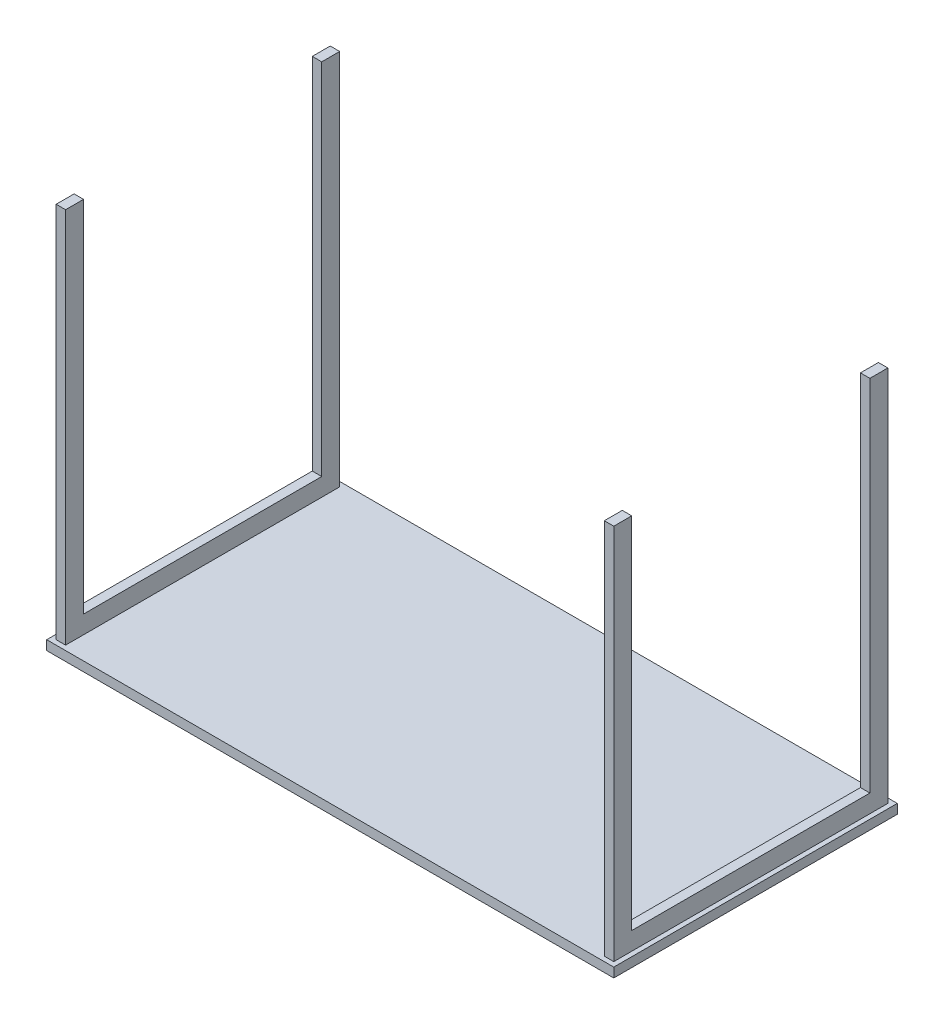
ISO-10303-21;
HEADER;
FILE_DESCRIPTION(('STEP AP214'),'2;1');
FILE_NAME('part.step','',(''),(''),'','','');
FILE_SCHEMA(('AUTOMOTIVE_DESIGN { 1 0 10303 214 1 1 1 1 }'));
ENDSEC;
DATA;
#1=APPLICATION_CONTEXT('core data for automotive mechanical design processes');
#2=APPLICATION_PROTOCOL_DEFINITION('international standard','automotive_design',2000,#1);
#3=PRODUCT_CONTEXT('',#1,'mechanical');
#4=PRODUCT('Part','Part','',(#3));
#5=PRODUCT_RELATED_PRODUCT_CATEGORY('part','',(#4));
#6=PRODUCT_DEFINITION_FORMATION('','',#4);
#7=PRODUCT_DEFINITION_CONTEXT('part definition',#1,'design');
#8=PRODUCT_DEFINITION('design','',#6,#7);
#9=PRODUCT_DEFINITION_SHAPE('','',#8);
#10=(LENGTH_UNIT() NAMED_UNIT(*) SI_UNIT(.MILLI.,.METRE.));
#11=(NAMED_UNIT(*) PLANE_ANGLE_UNIT() SI_UNIT($,.RADIAN.));
#12=(NAMED_UNIT(*) SI_UNIT($,.STERADIAN.) SOLID_ANGLE_UNIT());
#13=UNCERTAINTY_MEASURE_WITH_UNIT(LENGTH_MEASURE(1.E-05),#10,'distance_accuracy_value','');
#14=(GEOMETRIC_REPRESENTATION_CONTEXT(3) GLOBAL_UNCERTAINTY_ASSIGNED_CONTEXT((#13)) GLOBAL_UNIT_ASSIGNED_CONTEXT((#10,
#11,#12)) REPRESENTATION_CONTEXT('',''));
#15=CARTESIAN_POINT('',(0.,0.,0.));
#16=DIRECTION('',(0.,0.,1.));
#17=DIRECTION('',(1.,0.,0.));
#18=AXIS2_PLACEMENT_3D('',#15,#16,#17);
#19=CARTESIAN_POINT('',(1170.,58.,-590.));
#20=DIRECTION('',(0.,1.,0.));
#21=DIRECTION('',(0.,0.,1.));
#22=AXIS2_PLACEMENT_3D('',#19,#20,#21);
#23=PLANE('',#22);
#24=DIRECTION('',(0.,0.,-1.));
#25=VECTOR('',#24,1.);
#26=CARTESIAN_POINT('',(1190.,58.,-590.));
#27=LINE('',#26,#25);
#28=CARTESIAN_POINT('',(1190.,58.,-48.0000000000003));
#29=VERTEX_POINT('',#28);
#30=CARTESIAN_POINT('',(1190.,58.,-552.));
#31=VERTEX_POINT('',#30);
#32=EDGE_CURVE('E54',#29,#31,#27,.T.);
#33=ORIENTED_EDGE('',*,*,#32,.T.);
#34=DIRECTION('',(1.,0.,0.));
#35=VECTOR('',#34,1.);
#36=CARTESIAN_POINT('',(1190.,58.,-552.));
#37=LINE('',#36,#35);
#38=CARTESIAN_POINT('',(1170.,58.,-552.));
#39=VERTEX_POINT('',#38);
#40=EDGE_CURVE('E49',#39,#31,#37,.T.);
#41=ORIENTED_EDGE('',*,*,#40,.F.);
#42=DIRECTION('',(0.,0.,1.));
#43=VECTOR('',#42,1.);
#44=CARTESIAN_POINT('',(1170.,58.,-590.));
#45=LINE('',#44,#43);
#46=CARTESIAN_POINT('',(1170.,58.,-48.0000000000003));
#47=VERTEX_POINT('',#46);
#48=EDGE_CURVE('E35',#39,#47,#45,.T.);
#49=ORIENTED_EDGE('',*,*,#48,.T.);
#50=DIRECTION('',(-1.,0.,0.));
#51=VECTOR('',#50,1.);
#52=CARTESIAN_POINT('',(1190.,58.,-48.0000000000003));
#53=LINE('',#52,#51);
#54=EDGE_CURVE('E204',#29,#47,#53,.T.);
#55=ORIENTED_EDGE('',*,*,#54,.F.);
#56=EDGE_LOOP('',(#33,#41,#49,#55));
#57=FACE_BOUND('',#56,.T.);
#58=ADVANCED_FACE('F31',(#57),#23,.T.);
#59=CARTESIAN_POINT('',(30.,58.,-590.));
#60=DIRECTION('',(0.,-1.,0.));
#61=DIRECTION('',(0.,0.,-1.));
#62=AXIS2_PLACEMENT_3D('',#59,#60,#61);
#63=PLANE('',#62);
#64=DIRECTION('',(-1.,0.,0.));
#65=VECTOR('',#64,1.);
#66=CARTESIAN_POINT('',(10.0000000000001,58.,-48.));
#67=LINE('',#66,#65);
#68=CARTESIAN_POINT('',(30.0000000000001,58.,-48.));
#69=VERTEX_POINT('',#68);
#70=CARTESIAN_POINT('',(10.0000000000001,58.,-48.));
#71=VERTEX_POINT('',#70);
#72=EDGE_CURVE('E232',#69,#71,#67,.T.);
#73=ORIENTED_EDGE('',*,*,#72,.F.);
#74=DIRECTION('',(0.,0.,-1.));
#75=VECTOR('',#74,1.);
#76=CARTESIAN_POINT('',(30.,58.,-590.));
#77=LINE('',#76,#75);
#78=CARTESIAN_POINT('',(30.,58.,-552.));
#79=VERTEX_POINT('',#78);
#80=EDGE_CURVE('E282',#69,#79,#77,.T.);
#81=ORIENTED_EDGE('',*,*,#80,.T.);
#82=DIRECTION('',(1.,0.,0.));
#83=VECTOR('',#82,1.);
#84=CARTESIAN_POINT('',(10.,58.,-552.));
#85=LINE('',#84,#83);
#86=CARTESIAN_POINT('',(10.,58.,-552.));
#87=VERTEX_POINT('',#86);
#88=EDGE_CURVE('E254',#87,#79,#85,.T.);
#89=ORIENTED_EDGE('',*,*,#88,.F.);
#90=DIRECTION('',(0.,0.,1.));
#91=VECTOR('',#90,1.);
#92=CARTESIAN_POINT('',(10.,58.,-590.));
#93=LINE('',#92,#91);
#94=EDGE_CURVE('E272',#87,#71,#93,.T.);
#95=ORIENTED_EDGE('',*,*,#94,.T.);
#96=EDGE_LOOP('',(#73,#81,#89,#95));
#97=FACE_BOUND('',#96,.T.);
#98=ADVANCED_FACE('F360',(#97),#63,.F.);
#99=CARTESIAN_POINT('',(1200.,20.,0.));
#100=DIRECTION('',(0.,1.,0.));
#101=DIRECTION('',(0.,0.,1.));
#102=AXIS2_PLACEMENT_3D('',#99,#100,#101);
#103=PLANE('',#102);
#104=DIRECTION('',(0.,0.,1.));
#105=VECTOR('',#104,1.);
#106=CARTESIAN_POINT('',(10.,20.,-590.));
#107=LINE('',#106,#105);
#108=CARTESIAN_POINT('',(10.,20.,-590.));
#109=VERTEX_POINT('',#108);
#110=CARTESIAN_POINT('',(10.0000000000001,20.,-10.));
#111=VERTEX_POINT('',#110);
#112=EDGE_CURVE('E290',#109,#111,#107,.T.);
#113=ORIENTED_EDGE('',*,*,#112,.F.);
#114=DIRECTION('',(-1.,0.,0.));
#115=VECTOR('',#114,1.);
#116=CARTESIAN_POINT('',(10.,20.,-590.));
#117=LINE('',#116,#115);
#118=CARTESIAN_POINT('',(30.,20.,-590.));
#119=VERTEX_POINT('',#118);
#120=EDGE_CURVE('E179',#119,#109,#117,.T.);
#121=ORIENTED_EDGE('',*,*,#120,.F.);
#122=DIRECTION('',(0.,0.,-1.));
#123=VECTOR('',#122,1.);
#124=CARTESIAN_POINT('',(30.,20.,-590.));
#125=LINE('',#124,#123);
#126=CARTESIAN_POINT('',(30.,20.,-10.));
#127=VERTEX_POINT('',#126);
#128=EDGE_CURVE('E295',#127,#119,#125,.T.);
#129=ORIENTED_EDGE('',*,*,#128,.F.);
#130=DIRECTION('',(1.,0.,0.));
#131=VECTOR('',#130,1.);
#132=CARTESIAN_POINT('',(10.0000000000001,20.,-10.));
#133=LINE('',#132,#131);
#134=EDGE_CURVE('E292',#111,#127,#133,.T.);
#135=ORIENTED_EDGE('',*,*,#134,.F.);
#136=EDGE_LOOP('',(#113,#121,#129,#135));
#137=FACE_BOUND('',#136,.T.);
#138=DIRECTION('',(1.,0.,0.));
#139=VECTOR('',#138,1.);
#140=CARTESIAN_POINT('',(0.,20.,0.));
#141=LINE('',#140,#139);
#142=CARTESIAN_POINT('',(0.,20.,0.));
#143=VERTEX_POINT('',#142);
#144=CARTESIAN_POINT('',(1200.,20.,0.));
#145=VERTEX_POINT('',#144);
#146=EDGE_CURVE('E307',#143,#145,#141,.T.);
#147=ORIENTED_EDGE('',*,*,#146,.T.);
#148=DIRECTION('',(0.,0.,-1.));
#149=VECTOR('',#148,1.);
#150=CARTESIAN_POINT('',(1200.,20.,0.));
#151=LINE('',#150,#149);
#152=CARTESIAN_POINT('',(1200.,20.,-600.));
#153=VERTEX_POINT('',#152);
#154=EDGE_CURVE('E310',#145,#153,#151,.T.);
#155=ORIENTED_EDGE('',*,*,#154,.T.);
#156=DIRECTION('',(-1.,0.,0.));
#157=VECTOR('',#156,1.);
#158=CARTESIAN_POINT('',(0.,20.,-600.));
#159=LINE('',#158,#157);
#160=CARTESIAN_POINT('',(0.,20.,-600.));
#161=VERTEX_POINT('',#160);
#162=EDGE_CURVE('E313',#153,#161,#159,.T.);
#163=ORIENTED_EDGE('',*,*,#162,.T.);
#164=DIRECTION('',(0.,0.,1.));
#165=VECTOR('',#164,1.);
#166=CARTESIAN_POINT('',(0.,20.,0.));
#167=LINE('',#166,#165);
#168=EDGE_CURVE('E315',#161,#143,#167,.T.);
#169=ORIENTED_EDGE('',*,*,#168,.T.);
#170=EDGE_LOOP('',(#147,#155,#163,#169));
#171=FACE_BOUND('',#170,.T.);
#172=DIRECTION('',(0.,0.,1.));
#173=VECTOR('',#172,1.);
#174=CARTESIAN_POINT('',(1170.,20.,-590.));
#175=LINE('',#174,#173);
#176=CARTESIAN_POINT('',(1170.,20.,-590.));
#177=VERTEX_POINT('',#176);
#178=CARTESIAN_POINT('',(1170.,20.,-10.0000000000002));
#179=VERTEX_POINT('',#178);
#180=EDGE_CURVE('E622',#177,#179,#175,.T.);
#181=ORIENTED_EDGE('',*,*,#180,.F.);
#182=DIRECTION('',(-1.,0.,0.));
#183=VECTOR('',#182,1.);
#184=CARTESIAN_POINT('',(1190.,20.,-590.));
#185=LINE('',#184,#183);
#186=CARTESIAN_POINT('',(1190.,20.,-590.));
#187=VERTEX_POINT('',#186);
#188=EDGE_CURVE('E176',#187,#177,#185,.T.);
#189=ORIENTED_EDGE('',*,*,#188,.F.);
#190=DIRECTION('',(0.,0.,-1.));
#191=VECTOR('',#190,1.);
#192=CARTESIAN_POINT('',(1190.,20.,-590.));
#193=LINE('',#192,#191);
#194=CARTESIAN_POINT('',(1190.,20.,-10.0000000000002));
#195=VERTEX_POINT('',#194);
#196=EDGE_CURVE('E609',#195,#187,#193,.T.);
#197=ORIENTED_EDGE('',*,*,#196,.F.);
#198=DIRECTION('',(1.,0.,0.));
#199=VECTOR('',#198,1.);
#200=CARTESIAN_POINT('',(1190.,20.,-10.0000000000002));
#201=LINE('',#200,#199);
#202=EDGE_CURVE('E620',#179,#195,#201,.T.);
#203=ORIENTED_EDGE('',*,*,#202,.F.);
#204=EDGE_LOOP('',(#181,#189,#197,#203));
#205=FACE_BOUND('',#204,.T.);
#206=ADVANCED_FACE('F350',(#137,#171,#205),#103,.T.);
#207=CARTESIAN_POINT('',(0.,20.,0.));
#208=DIRECTION('',(0.,0.,-1.));
#209=DIRECTION('',(-1.,0.,0.));
#210=AXIS2_PLACEMENT_3D('',#207,#208,#209);
#211=PLANE('',#210);
#212=DIRECTION('',(1.,0.,0.));
#213=VECTOR('',#212,1.);
#214=CARTESIAN_POINT('',(0.,0.,0.));
#215=LINE('',#214,#213);
#216=CARTESIAN_POINT('',(0.,0.,0.));
#217=VERTEX_POINT('',#216);
#218=CARTESIAN_POINT('',(1200.,0.,0.));
#219=VERTEX_POINT('',#218);
#220=EDGE_CURVE('E306',#217,#219,#215,.T.);
#221=ORIENTED_EDGE('',*,*,#220,.T.);
#222=DIRECTION('',(0.,-1.,0.));
#223=VECTOR('',#222,1.);
#224=CARTESIAN_POINT('',(1200.,20.,0.));
#225=LINE('',#224,#223);
#226=EDGE_CURVE('E11',#145,#219,#225,.T.);
#227=ORIENTED_EDGE('',*,*,#226,.F.);
#228=ORIENTED_EDGE('',*,*,#146,.F.);
#229=DIRECTION('',(0.,-1.,0.));
#230=VECTOR('',#229,1.);
#231=CARTESIAN_POINT('',(0.,20.,0.));
#232=LINE('',#231,#230);
#233=EDGE_CURVE('E317',#143,#217,#232,.T.);
#234=ORIENTED_EDGE('',*,*,#233,.T.);
#235=EDGE_LOOP('',(#221,#227,#228,#234));
#236=FACE_BOUND('',#235,.T.);
#237=ADVANCED_FACE('F33',(#236),#211,.F.);
#238=CARTESIAN_POINT('',(1200.,20.,0.));
#239=DIRECTION('',(-1.,0.,0.));
#240=DIRECTION('',(0.,0.,1.));
#241=AXIS2_PLACEMENT_3D('',#238,#239,#240);
#242=PLANE('',#241);
#243=DIRECTION('',(0.,0.,-1.));
#244=VECTOR('',#243,1.);
#245=CARTESIAN_POINT('',(1200.,0.,0.));
#246=LINE('',#245,#244);
#247=CARTESIAN_POINT('',(1200.,0.,-600.));
#248=VERTEX_POINT('',#247);
#249=EDGE_CURVE('E320',#219,#248,#246,.T.);
#250=ORIENTED_EDGE('',*,*,#249,.T.);
#251=DIRECTION('',(0.,-1.,0.));
#252=VECTOR('',#251,1.);
#253=CARTESIAN_POINT('',(1200.,20.,-600.));
#254=LINE('',#253,#252);
#255=EDGE_CURVE('E41',#153,#248,#254,.T.);
#256=ORIENTED_EDGE('',*,*,#255,.F.);
#257=ORIENTED_EDGE('',*,*,#154,.F.);
#258=ORIENTED_EDGE('',*,*,#226,.T.);
#259=EDGE_LOOP('',(#250,#256,#257,#258));
#260=FACE_BOUND('',#259,.T.);
#261=ADVANCED_FACE('F352',(#260),#242,.F.);
#262=CARTESIAN_POINT('',(0.,20.,-600.));
#263=DIRECTION('',(0.,0.,1.));
#264=DIRECTION('',(1.,0.,0.));
#265=AXIS2_PLACEMENT_3D('',#262,#263,#264);
#266=PLANE('',#265);
#267=DIRECTION('',(-1.,0.,0.));
#268=VECTOR('',#267,1.);
#269=CARTESIAN_POINT('',(0.,0.,-600.));
#270=LINE('',#269,#268);
#271=CARTESIAN_POINT('',(0.,0.,-600.));
#272=VERTEX_POINT('',#271);
#273=EDGE_CURVE('E322',#248,#272,#270,.T.);
#274=ORIENTED_EDGE('',*,*,#273,.T.);
#275=DIRECTION('',(0.,-1.,0.));
#276=VECTOR('',#275,1.);
#277=CARTESIAN_POINT('',(0.,20.,-600.));
#278=LINE('',#277,#276);
#279=EDGE_CURVE('E327',#161,#272,#278,.T.);
#280=ORIENTED_EDGE('',*,*,#279,.F.);
#281=ORIENTED_EDGE('',*,*,#162,.F.);
#282=ORIENTED_EDGE('',*,*,#255,.T.);
#283=EDGE_LOOP('',(#274,#280,#281,#282));
#284=FACE_BOUND('',#283,.T.);
#285=ADVANCED_FACE('F335',(#284),#266,.F.);
#286=CARTESIAN_POINT('',(0.,20.,0.));
#287=DIRECTION('',(1.,0.,0.));
#288=DIRECTION('',(0.,0.,-1.));
#289=AXIS2_PLACEMENT_3D('',#286,#287,#288);
#290=PLANE('',#289);
#291=DIRECTION('',(0.,0.,1.));
#292=VECTOR('',#291,1.);
#293=CARTESIAN_POINT('',(0.,0.,0.));
#294=LINE('',#293,#292);
#295=EDGE_CURVE('E311',#272,#217,#294,.T.);
#296=ORIENTED_EDGE('',*,*,#295,.T.);
#297=ORIENTED_EDGE('',*,*,#233,.F.);
#298=ORIENTED_EDGE('',*,*,#168,.F.);
#299=ORIENTED_EDGE('',*,*,#279,.T.);
#300=EDGE_LOOP('',(#296,#297,#298,#299));
#301=FACE_BOUND('',#300,.T.);
#302=ADVANCED_FACE('F344',(#301),#290,.F.);
#303=CARTESIAN_POINT('',(1200.,0.,0.));
#304=DIRECTION('',(0.,1.,0.));
#305=DIRECTION('',(0.,0.,1.));
#306=AXIS2_PLACEMENT_3D('',#303,#304,#305);
#307=PLANE('',#306);
#308=ORIENTED_EDGE('',*,*,#220,.F.);
#309=ORIENTED_EDGE('',*,*,#295,.F.);
#310=ORIENTED_EDGE('',*,*,#273,.F.);
#311=ORIENTED_EDGE('',*,*,#249,.F.);
#312=EDGE_LOOP('',(#308,#309,#310,#311));
#313=FACE_BOUND('',#312,.T.);
#314=ADVANCED_FACE('F341',(#313),#307,.F.);
#315=CARTESIAN_POINT('',(10.,58.,-590.));
#316=DIRECTION('',(0.,0.,1.));
#317=DIRECTION('',(1.,0.,0.));
#318=AXIS2_PLACEMENT_3D('',#315,#316,#317);
#319=PLANE('',#318);
#320=ORIENTED_EDGE('',*,*,#120,.T.);
#321=DIRECTION('',(0.,-1.,0.));
#322=VECTOR('',#321,1.);
#323=CARTESIAN_POINT('',(10.,58.,-590.));
#324=LINE('',#323,#322);
#325=CARTESIAN_POINT('',(10.,818.,-590.));
#326=VERTEX_POINT('',#325);
#327=EDGE_CURVE('E304',#326,#109,#324,.T.);
#328=ORIENTED_EDGE('',*,*,#327,.F.);
#329=DIRECTION('',(-1.,0.,0.));
#330=VECTOR('',#329,1.);
#331=CARTESIAN_POINT('',(10.,818.,-590.));
#332=LINE('',#331,#330);
#333=CARTESIAN_POINT('',(30.,818.,-590.));
#334=VERTEX_POINT('',#333);
#335=EDGE_CURVE('E255',#334,#326,#332,.T.);
#336=ORIENTED_EDGE('',*,*,#335,.F.);
#337=DIRECTION('',(0.,-1.,0.));
#338=VECTOR('',#337,1.);
#339=CARTESIAN_POINT('',(30.,58.,-590.));
#340=LINE('',#339,#338);
#341=EDGE_CURVE('E284',#334,#119,#340,.T.);
#342=ORIENTED_EDGE('',*,*,#341,.T.);
#343=EDGE_LOOP('',(#320,#328,#336,#342));
#344=FACE_BOUND('',#343,.T.);
#345=ADVANCED_FACE('F394',(#344),#319,.F.);
#346=CARTESIAN_POINT('',(10.,58.,-590.));
#347=DIRECTION('',(1.,0.,0.));
#348=DIRECTION('',(0.,0.,-1.));
#349=AXIS2_PLACEMENT_3D('',#346,#347,#348);
#350=PLANE('',#349);
#351=ORIENTED_EDGE('',*,*,#112,.T.);
#352=DIRECTION('',(0.,-1.,0.));
#353=VECTOR('',#352,1.);
#354=CARTESIAN_POINT('',(10.0000000000001,58.,-10.));
#355=LINE('',#354,#353);
#356=CARTESIAN_POINT('',(10.0000000000001,818.,-10.));
#357=VERTEX_POINT('',#356);
#358=EDGE_CURVE('E301',#357,#111,#355,.T.);
#359=ORIENTED_EDGE('',*,*,#358,.F.);
#360=DIRECTION('',(0.,0.,1.));
#361=VECTOR('',#360,1.);
#362=CARTESIAN_POINT('',(10.0000000000001,818.,-10.));
#363=LINE('',#362,#361);
#364=CARTESIAN_POINT('',(10.0000000000001,818.,-48.));
#365=VERTEX_POINT('',#364);
#366=EDGE_CURVE('E248',#365,#357,#363,.T.);
#367=ORIENTED_EDGE('',*,*,#366,.F.);
#368=DIRECTION('',(0.,-1.,0.));
#369=VECTOR('',#368,1.);
#370=CARTESIAN_POINT('',(10.0000000000001,818.,-48.));
#371=LINE('',#370,#369);
#372=EDGE_CURVE('E250',#365,#71,#371,.T.);
#373=ORIENTED_EDGE('',*,*,#372,.T.);
#374=ORIENTED_EDGE('',*,*,#94,.F.);
#375=DIRECTION('',(0.,-1.,0.));
#376=VECTOR('',#375,1.);
#377=CARTESIAN_POINT('',(10.,818.,-552.));
#378=LINE('',#377,#376);
#379=CARTESIAN_POINT('',(10.,818.,-552.));
#380=VERTEX_POINT('',#379);
#381=EDGE_CURVE('E276',#380,#87,#378,.T.);
#382=ORIENTED_EDGE('',*,*,#381,.F.);
#383=DIRECTION('',(0.,0.,1.));
#384=VECTOR('',#383,1.);
#385=CARTESIAN_POINT('',(10.,818.,-590.));
#386=LINE('',#385,#384);
#387=EDGE_CURVE('E258',#326,#380,#386,.T.);
#388=ORIENTED_EDGE('',*,*,#387,.F.);
#389=ORIENTED_EDGE('',*,*,#327,.T.);
#390=EDGE_LOOP('',(#351,#359,#367,#373,#374,#382,#388,#389));
#391=FACE_BOUND('',#390,.T.);
#392=ADVANCED_FACE('F390',(#391),#350,.F.);
#393=CARTESIAN_POINT('',(10.0000000000001,58.,-10.));
#394=DIRECTION('',(0.,0.,-1.));
#395=DIRECTION('',(-1.,0.,0.));
#396=AXIS2_PLACEMENT_3D('',#393,#394,#395);
#397=PLANE('',#396);
#398=ORIENTED_EDGE('',*,*,#134,.T.);
#399=DIRECTION('',(0.,-1.,0.));
#400=VECTOR('',#399,1.);
#401=CARTESIAN_POINT('',(30.0000000000001,58.,-10.));
#402=LINE('',#401,#400);
#403=CARTESIAN_POINT('',(30.0000000000001,818.,-10.));
#404=VERTEX_POINT('',#403);
#405=EDGE_CURVE('E299',#404,#127,#402,.T.);
#406=ORIENTED_EDGE('',*,*,#405,.F.);
#407=DIRECTION('',(1.,0.,0.));
#408=VECTOR('',#407,1.);
#409=CARTESIAN_POINT('',(10.0000000000001,818.,-10.));
#410=LINE('',#409,#408);
#411=EDGE_CURVE('E218',#357,#404,#410,.T.);
#412=ORIENTED_EDGE('',*,*,#411,.F.);
#413=ORIENTED_EDGE('',*,*,#358,.T.);
#414=EDGE_LOOP('',(#398,#406,#412,#413));
#415=FACE_BOUND('',#414,.T.);
#416=ADVANCED_FACE('F386',(#415),#397,.F.);
#417=CARTESIAN_POINT('',(30.,58.,-590.));
#418=DIRECTION('',(-1.,0.,0.));
#419=DIRECTION('',(0.,0.,1.));
#420=AXIS2_PLACEMENT_3D('',#417,#418,#419);
#421=PLANE('',#420);
#422=ORIENTED_EDGE('',*,*,#128,.T.);
#423=ORIENTED_EDGE('',*,*,#341,.F.);
#424=DIRECTION('',(0.,0.,-1.));
#425=VECTOR('',#424,1.);
#426=CARTESIAN_POINT('',(30.,818.,-590.));
#427=LINE('',#426,#425);
#428=CARTESIAN_POINT('',(30.,818.,-552.));
#429=VERTEX_POINT('',#428);
#430=EDGE_CURVE('E262',#429,#334,#427,.T.);
#431=ORIENTED_EDGE('',*,*,#430,.F.);
#432=DIRECTION('',(0.,-1.,0.));
#433=VECTOR('',#432,1.);
#434=CARTESIAN_POINT('',(30.,818.,-552.));
#435=LINE('',#434,#433);
#436=EDGE_CURVE('E265',#429,#79,#435,.T.);
#437=ORIENTED_EDGE('',*,*,#436,.T.);
#438=ORIENTED_EDGE('',*,*,#80,.F.);
#439=DIRECTION('',(0.,-1.,0.));
#440=VECTOR('',#439,1.);
#441=CARTESIAN_POINT('',(30.0000000000001,818.,-48.));
#442=LINE('',#441,#440);
#443=CARTESIAN_POINT('',(30.0000000000001,818.,-48.));
#444=VERTEX_POINT('',#443);
#445=EDGE_CURVE('E252',#444,#69,#442,.T.);
#446=ORIENTED_EDGE('',*,*,#445,.F.);
#447=DIRECTION('',(0.,0.,-1.));
#448=VECTOR('',#447,1.);
#449=CARTESIAN_POINT('',(30.0000000000001,818.,-10.));
#450=LINE('',#449,#448);
#451=EDGE_CURVE('E245',#404,#444,#450,.T.);
#452=ORIENTED_EDGE('',*,*,#451,.F.);
#453=ORIENTED_EDGE('',*,*,#405,.T.);
#454=EDGE_LOOP('',(#422,#423,#431,#437,#438,#446,#452,#453));
#455=FACE_BOUND('',#454,.T.);
#456=ADVANCED_FACE('F382',(#455),#421,.F.);
#457=CARTESIAN_POINT('',(1190.,58.,-590.));
#458=DIRECTION('',(0.,0.,1.));
#459=DIRECTION('',(1.,0.,0.));
#460=AXIS2_PLACEMENT_3D('',#457,#458,#459);
#461=PLANE('',#460);
#462=ORIENTED_EDGE('',*,*,#188,.T.);
#463=DIRECTION('',(0.,-1.,0.));
#464=VECTOR('',#463,1.);
#465=CARTESIAN_POINT('',(1170.,58.,-590.));
#466=LINE('',#465,#464);
#467=CARTESIAN_POINT('',(1170.,818.,-590.));
#468=VERTEX_POINT('',#467);
#469=EDGE_CURVE('E169',#468,#177,#466,.T.);
#470=ORIENTED_EDGE('',*,*,#469,.F.);
#471=DIRECTION('',(-1.,0.,0.));
#472=VECTOR('',#471,1.);
#473=CARTESIAN_POINT('',(1190.,818.,-590.));
#474=LINE('',#473,#472);
#475=CARTESIAN_POINT('',(1190.,818.,-590.));
#476=VERTEX_POINT('',#475);
#477=EDGE_CURVE('E174',#476,#468,#474,.T.);
#478=ORIENTED_EDGE('',*,*,#477,.F.);
#479=DIRECTION('',(0.,-1.,0.));
#480=VECTOR('',#479,1.);
#481=CARTESIAN_POINT('',(1190.,58.,-590.));
#482=LINE('',#481,#480);
#483=EDGE_CURVE('E607',#476,#187,#482,.T.);
#484=ORIENTED_EDGE('',*,*,#483,.T.);
#485=EDGE_LOOP('',(#462,#470,#478,#484));
#486=FACE_BOUND('',#485,.T.);
#487=ADVANCED_FACE('F171',(#486),#461,.F.);
#488=CARTESIAN_POINT('',(1170.,58.,-590.));
#489=DIRECTION('',(1.,0.,0.));
#490=DIRECTION('',(0.,0.,-1.));
#491=AXIS2_PLACEMENT_3D('',#488,#489,#490);
#492=PLANE('',#491);
#493=ORIENTED_EDGE('',*,*,#180,.T.);
#494=DIRECTION('',(0.,-1.,0.));
#495=VECTOR('',#494,1.);
#496=CARTESIAN_POINT('',(1170.,58.,-10.0000000000002));
#497=LINE('',#496,#495);
#498=CARTESIAN_POINT('',(1170.,818.,-10.0000000000002));
#499=VERTEX_POINT('',#498);
#500=EDGE_CURVE('E180',#499,#179,#497,.T.);
#501=ORIENTED_EDGE('',*,*,#500,.F.);
#502=DIRECTION('',(0.,0.,1.));
#503=VECTOR('',#502,1.);
#504=CARTESIAN_POINT('',(1170.,818.,-10.0000000000002));
#505=LINE('',#504,#503);
#506=CARTESIAN_POINT('',(1170.,818.,-48.0000000000003));
#507=VERTEX_POINT('',#506);
#508=EDGE_CURVE('E212',#507,#499,#505,.T.);
#509=ORIENTED_EDGE('',*,*,#508,.F.);
#510=DIRECTION('',(0.,-1.,0.));
#511=VECTOR('',#510,1.);
#512=CARTESIAN_POINT('',(1170.,818.,-48.0000000000003));
#513=LINE('',#512,#511);
#514=EDGE_CURVE('E215',#507,#47,#513,.T.);
#515=ORIENTED_EDGE('',*,*,#514,.T.);
#516=ORIENTED_EDGE('',*,*,#48,.F.);
#517=DIRECTION('',(0.,-1.,0.));
#518=VECTOR('',#517,1.);
#519=CARTESIAN_POINT('',(1170.,818.,-552.));
#520=LINE('',#519,#518);
#521=CARTESIAN_POINT('',(1170.,818.,-552.));
#522=VERTEX_POINT('',#521);
#523=EDGE_CURVE('E186',#522,#39,#520,.T.);
#524=ORIENTED_EDGE('',*,*,#523,.F.);
#525=DIRECTION('',(0.,0.,1.));
#526=VECTOR('',#525,1.);
#527=CARTESIAN_POINT('',(1170.,818.,-590.));
#528=LINE('',#527,#526);
#529=EDGE_CURVE('E183',#468,#522,#528,.T.);
#530=ORIENTED_EDGE('',*,*,#529,.F.);
#531=ORIENTED_EDGE('',*,*,#469,.T.);
#532=EDGE_LOOP('',(#493,#501,#509,#515,#516,#524,#530,#531));
#533=FACE_BOUND('',#532,.T.);
#534=ADVANCED_FACE('F184',(#533),#492,.F.);
#535=CARTESIAN_POINT('',(1190.,58.,-10.0000000000002));
#536=DIRECTION('',(0.,0.,-1.));
#537=DIRECTION('',(-1.,0.,0.));
#538=AXIS2_PLACEMENT_3D('',#535,#536,#537);
#539=PLANE('',#538);
#540=ORIENTED_EDGE('',*,*,#202,.T.);
#541=DIRECTION('',(0.,-1.,0.));
#542=VECTOR('',#541,1.);
#543=CARTESIAN_POINT('',(1190.,58.,-10.0000000000002));
#544=LINE('',#543,#542);
#545=CARTESIAN_POINT('',(1190.,818.,-10.0000000000002));
#546=VERTEX_POINT('',#545);
#547=EDGE_CURVE('E610',#546,#195,#544,.T.);
#548=ORIENTED_EDGE('',*,*,#547,.F.);
#549=DIRECTION('',(1.,0.,0.));
#550=VECTOR('',#549,1.);
#551=CARTESIAN_POINT('',(1190.,818.,-10.0000000000002));
#552=LINE('',#551,#550);
#553=EDGE_CURVE('E205',#499,#546,#552,.T.);
#554=ORIENTED_EDGE('',*,*,#553,.F.);
#555=ORIENTED_EDGE('',*,*,#500,.T.);
#556=EDGE_LOOP('',(#540,#548,#554,#555));
#557=FACE_BOUND('',#556,.T.);
#558=ADVANCED_FACE('F374',(#557),#539,.F.);
#559=CARTESIAN_POINT('',(1190.,58.,-590.));
#560=DIRECTION('',(-1.,0.,0.));
#561=DIRECTION('',(0.,0.,1.));
#562=AXIS2_PLACEMENT_3D('',#559,#560,#561);
#563=PLANE('',#562);
#564=ORIENTED_EDGE('',*,*,#196,.T.);
#565=ORIENTED_EDGE('',*,*,#483,.F.);
#566=DIRECTION('',(0.,0.,-1.));
#567=VECTOR('',#566,1.);
#568=CARTESIAN_POINT('',(1190.,818.,-590.));
#569=LINE('',#568,#567);
#570=CARTESIAN_POINT('',(1190.,818.,-552.));
#571=VERTEX_POINT('',#570);
#572=EDGE_CURVE('E194',#571,#476,#569,.T.);
#573=ORIENTED_EDGE('',*,*,#572,.F.);
#574=DIRECTION('',(0.,-1.,0.));
#575=VECTOR('',#574,1.);
#576=CARTESIAN_POINT('',(1190.,818.,-552.));
#577=LINE('',#576,#575);
#578=EDGE_CURVE('E199',#571,#31,#577,.T.);
#579=ORIENTED_EDGE('',*,*,#578,.T.);
#580=ORIENTED_EDGE('',*,*,#32,.F.);
#581=DIRECTION('',(0.,-1.,0.));
#582=VECTOR('',#581,1.);
#583=CARTESIAN_POINT('',(1190.,818.,-48.0000000000003));
#584=LINE('',#583,#582);
#585=CARTESIAN_POINT('',(1190.,818.,-48.0000000000003));
#586=VERTEX_POINT('',#585);
#587=EDGE_CURVE('E228',#586,#29,#584,.T.);
#588=ORIENTED_EDGE('',*,*,#587,.F.);
#589=DIRECTION('',(0.,0.,-1.));
#590=VECTOR('',#589,1.);
#591=CARTESIAN_POINT('',(1190.,818.,-10.0000000000002));
#592=LINE('',#591,#590);
#593=EDGE_CURVE('E208',#546,#586,#592,.T.);
#594=ORIENTED_EDGE('',*,*,#593,.F.);
#595=ORIENTED_EDGE('',*,*,#547,.T.);
#596=EDGE_LOOP('',(#564,#565,#573,#579,#580,#588,#594,#595));
#597=FACE_BOUND('',#596,.T.);
#598=ADVANCED_FACE('F371',(#597),#563,.F.);
#599=CARTESIAN_POINT('',(10.,818.,-552.));
#600=DIRECTION('',(0.,0.,-1.));
#601=DIRECTION('',(-1.,0.,0.));
#602=AXIS2_PLACEMENT_3D('',#599,#600,#601);
#603=PLANE('',#602);
#604=ORIENTED_EDGE('',*,*,#88,.T.);
#605=ORIENTED_EDGE('',*,*,#436,.F.);
#606=DIRECTION('',(1.,0.,0.));
#607=VECTOR('',#606,1.);
#608=CARTESIAN_POINT('',(10.,818.,-552.));
#609=LINE('',#608,#607);
#610=EDGE_CURVE('E260',#380,#429,#609,.T.);
#611=ORIENTED_EDGE('',*,*,#610,.F.);
#612=ORIENTED_EDGE('',*,*,#381,.T.);
#613=EDGE_LOOP('',(#604,#605,#611,#612));
#614=FACE_BOUND('',#613,.T.);
#615=ADVANCED_FACE('F369',(#614),#603,.F.);
#616=CARTESIAN_POINT('',(30.,818.,-590.));
#617=DIRECTION('',(0.,-1.,0.));
#618=DIRECTION('',(0.,0.,-1.));
#619=AXIS2_PLACEMENT_3D('',#616,#617,#618);
#620=PLANE('',#619);
#621=ORIENTED_EDGE('',*,*,#335,.T.);
#622=ORIENTED_EDGE('',*,*,#387,.T.);
#623=ORIENTED_EDGE('',*,*,#610,.T.);
#624=ORIENTED_EDGE('',*,*,#430,.T.);
#625=EDGE_LOOP('',(#621,#622,#623,#624));
#626=FACE_BOUND('',#625,.T.);
#627=ADVANCED_FACE('F453',(#626),#620,.F.);
#628=CARTESIAN_POINT('',(10.0000000000001,818.,-48.));
#629=DIRECTION('',(0.,0.,1.));
#630=DIRECTION('',(1.,0.,0.));
#631=AXIS2_PLACEMENT_3D('',#628,#629,#630);
#632=PLANE('',#631);
#633=ORIENTED_EDGE('',*,*,#72,.T.);
#634=ORIENTED_EDGE('',*,*,#372,.F.);
#635=DIRECTION('',(-1.,0.,0.));
#636=VECTOR('',#635,1.);
#637=CARTESIAN_POINT('',(10.0000000000001,818.,-48.));
#638=LINE('',#637,#636);
#639=EDGE_CURVE('E636',#444,#365,#638,.T.);
#640=ORIENTED_EDGE('',*,*,#639,.F.);
#641=ORIENTED_EDGE('',*,*,#445,.T.);
#642=EDGE_LOOP('',(#633,#634,#640,#641));
#643=FACE_BOUND('',#642,.T.);
#644=ADVANCED_FACE('F460',(#643),#632,.F.);
#645=CARTESIAN_POINT('',(30.0000000000001,818.,-10.));
#646=DIRECTION('',(0.,1.,0.));
#647=DIRECTION('',(0.,0.,1.));
#648=AXIS2_PLACEMENT_3D('',#645,#646,#647);
#649=PLANE('',#648);
#650=ORIENTED_EDGE('',*,*,#411,.T.);
#651=ORIENTED_EDGE('',*,*,#451,.T.);
#652=ORIENTED_EDGE('',*,*,#639,.T.);
#653=ORIENTED_EDGE('',*,*,#366,.T.);
#654=EDGE_LOOP('',(#650,#651,#652,#653));
#655=FACE_BOUND('',#654,.T.);
#656=ADVANCED_FACE('F467',(#655),#649,.T.);
#657=CARTESIAN_POINT('',(1190.,818.,-48.0000000000003));
#658=DIRECTION('',(0.,0.,1.));
#659=DIRECTION('',(1.,0.,0.));
#660=AXIS2_PLACEMENT_3D('',#657,#658,#659);
#661=PLANE('',#660);
#662=ORIENTED_EDGE('',*,*,#54,.T.);
#663=ORIENTED_EDGE('',*,*,#514,.F.);
#664=DIRECTION('',(-1.,0.,0.));
#665=VECTOR('',#664,1.);
#666=CARTESIAN_POINT('',(1190.,818.,-48.0000000000003));
#667=LINE('',#666,#665);
#668=EDGE_CURVE('E210',#586,#507,#667,.T.);
#669=ORIENTED_EDGE('',*,*,#668,.F.);
#670=ORIENTED_EDGE('',*,*,#587,.T.);
#671=EDGE_LOOP('',(#662,#663,#669,#670));
#672=FACE_BOUND('',#671,.T.);
#673=ADVANCED_FACE('F474',(#672),#661,.F.);
#674=CARTESIAN_POINT('',(1170.,818.,-10.0000000000002));
#675=DIRECTION('',(0.,-1.,0.));
#676=DIRECTION('',(0.,0.,-1.));
#677=AXIS2_PLACEMENT_3D('',#674,#675,#676);
#678=PLANE('',#677);
#679=ORIENTED_EDGE('',*,*,#553,.T.);
#680=ORIENTED_EDGE('',*,*,#593,.T.);
#681=ORIENTED_EDGE('',*,*,#668,.T.);
#682=ORIENTED_EDGE('',*,*,#508,.T.);
#683=EDGE_LOOP('',(#679,#680,#681,#682));
#684=FACE_BOUND('',#683,.T.);
#685=ADVANCED_FACE('F482',(#684),#678,.F.);
#686=CARTESIAN_POINT('',(1190.,818.,-552.));
#687=DIRECTION('',(0.,0.,-1.));
#688=DIRECTION('',(-1.,0.,0.));
#689=AXIS2_PLACEMENT_3D('',#686,#687,#688);
#690=PLANE('',#689);
#691=ORIENTED_EDGE('',*,*,#40,.T.);
#692=ORIENTED_EDGE('',*,*,#578,.F.);
#693=DIRECTION('',(1.,0.,0.));
#694=VECTOR('',#693,1.);
#695=CARTESIAN_POINT('',(1190.,818.,-552.));
#696=LINE('',#695,#694);
#697=EDGE_CURVE('E189',#522,#571,#696,.T.);
#698=ORIENTED_EDGE('',*,*,#697,.F.);
#699=ORIENTED_EDGE('',*,*,#523,.T.);
#700=EDGE_LOOP('',(#691,#692,#698,#699));
#701=FACE_BOUND('',#700,.T.);
#702=ADVANCED_FACE('F489',(#701),#690,.F.);
#703=CARTESIAN_POINT('',(1170.,818.,-590.));
#704=DIRECTION('',(0.,1.,0.));
#705=DIRECTION('',(0.,0.,1.));
#706=AXIS2_PLACEMENT_3D('',#703,#704,#705);
#707=PLANE('',#706);
#708=ORIENTED_EDGE('',*,*,#477,.T.);
#709=ORIENTED_EDGE('',*,*,#529,.T.);
#710=ORIENTED_EDGE('',*,*,#697,.T.);
#711=ORIENTED_EDGE('',*,*,#572,.T.);
#712=EDGE_LOOP('',(#708,#709,#710,#711));
#713=FACE_BOUND('',#712,.T.);
#714=ADVANCED_FACE('F192',(#713),#707,.T.);
#715=CLOSED_SHELL('',(#58,#98,#206,#237,#261,#285,#302,#314,#345,#392,#416,#456,#487,#534,#558,
#598,#615,#627,#644,#656,#673,#685,#702,#714));
#716=MANIFOLD_SOLID_BREP('B2',#715);
#717=ADVANCED_BREP_SHAPE_REPRESENTATION('',(#18,#716),#14);
#718=SHAPE_DEFINITION_REPRESENTATION(#9,#717);
ENDSEC;
END-ISO-10303-21;
